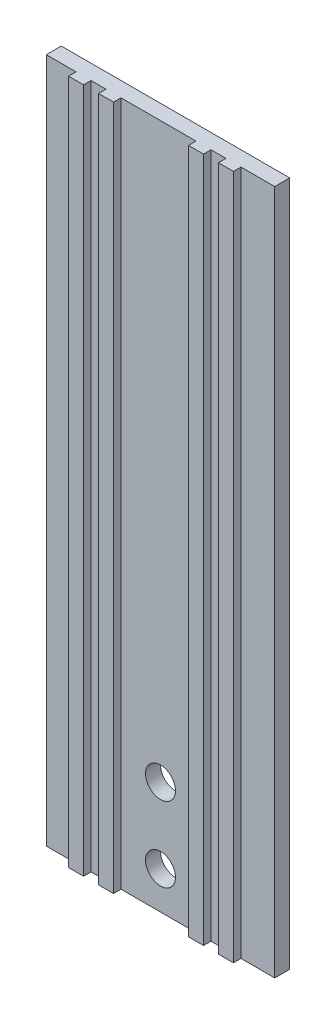
ISO-10303-21;
HEADER;
FILE_DESCRIPTION(('STEP AP214'),'2;1');
FILE_NAME('part.step','',(''),(''),'','','');
FILE_SCHEMA(('AUTOMOTIVE_DESIGN { 1 0 10303 214 1 1 1 1 }'));
ENDSEC;
DATA;
#1=APPLICATION_CONTEXT('core data for automotive mechanical design processes');
#2=APPLICATION_PROTOCOL_DEFINITION('international standard','automotive_design',2000,#1);
#3=PRODUCT_CONTEXT('',#1,'mechanical');
#4=PRODUCT('Part','Part','',(#3));
#5=PRODUCT_RELATED_PRODUCT_CATEGORY('part','',(#4));
#6=PRODUCT_DEFINITION_FORMATION('','',#4);
#7=PRODUCT_DEFINITION_CONTEXT('part definition',#1,'design');
#8=PRODUCT_DEFINITION('design','',#6,#7);
#9=PRODUCT_DEFINITION_SHAPE('','',#8);
#10=(LENGTH_UNIT() NAMED_UNIT(*) SI_UNIT(.MILLI.,.METRE.));
#11=(NAMED_UNIT(*) PLANE_ANGLE_UNIT() SI_UNIT($,.RADIAN.));
#12=(NAMED_UNIT(*) SI_UNIT($,.STERADIAN.) SOLID_ANGLE_UNIT());
#13=UNCERTAINTY_MEASURE_WITH_UNIT(LENGTH_MEASURE(1.E-05),#10,'distance_accuracy_value','');
#14=(GEOMETRIC_REPRESENTATION_CONTEXT(3) GLOBAL_UNCERTAINTY_ASSIGNED_CONTEXT((#13)) GLOBAL_UNIT_ASSIGNED_CONTEXT((#10,
#11,#12)) REPRESENTATION_CONTEXT('',''));
#15=CARTESIAN_POINT('',(0.,0.,0.));
#16=DIRECTION('',(0.,0.,1.));
#17=DIRECTION('',(1.,0.,0.));
#18=AXIS2_PLACEMENT_3D('',#15,#16,#17);
#19=CARTESIAN_POINT('',(0.,0.,10.));
#20=DIRECTION('',(0.,0.,1.));
#21=DIRECTION('',(1.,0.,0.));
#22=AXIS2_PLACEMENT_3D('',#19,#20,#21);
#23=PLANE('',#22);
#24=DIRECTION('',(1.,0.,0.));
#25=VECTOR('',#24,1.);
#26=CARTESIAN_POINT('',(0.,228.6,10.));
#27=LINE('',#26,#25);
#28=CARTESIAN_POINT('',(-46.3342334233424,228.6,10.));
#29=VERTEX_POINT('',#28);
#30=CARTESIAN_POINT('',(-36.3342334233425,228.6,10.));
#31=VERTEX_POINT('',#30);
#32=EDGE_CURVE('E312',#29,#31,#27,.T.);
#33=ORIENTED_EDGE('',*,*,#32,.F.);
#34=DIRECTION('',(0.,-1.,0.));
#35=VECTOR('',#34,1.);
#36=CARTESIAN_POINT('',(-46.3342334233424,228.6,10.));
#37=LINE('',#36,#35);
#38=CARTESIAN_POINT('',(-46.3342334233424,-228.6,10.));
#39=VERTEX_POINT('',#38);
#40=EDGE_CURVE('E247',#29,#39,#37,.T.);
#41=ORIENTED_EDGE('',*,*,#40,.T.);
#42=DIRECTION('',(-1.,0.,0.));
#43=VECTOR('',#42,1.);
#44=CARTESIAN_POINT('',(0.,-228.6,10.));
#45=LINE('',#44,#43);
#46=CARTESIAN_POINT('',(-36.3342334233424,-228.6,10.));
#47=VERTEX_POINT('',#46);
#48=EDGE_CURVE('E358',#47,#39,#45,.T.);
#49=ORIENTED_EDGE('',*,*,#48,.F.);
#50=DIRECTION('',(0.,-1.,0.));
#51=VECTOR('',#50,1.);
#52=CARTESIAN_POINT('',(-36.3342334233425,228.6,10.));
#53=LINE('',#52,#51);
#54=EDGE_CURVE('E234',#31,#47,#53,.T.);
#55=ORIENTED_EDGE('',*,*,#54,.F.);
#56=EDGE_LOOP('',(#33,#41,#49,#55));
#57=FACE_BOUND('',#56,.T.);
#58=ADVANCED_FACE('F43',(#57),#23,.T.);
#59=CARTESIAN_POINT('',(0.,-153.6,10.));
#60=DIRECTION('',(0.,0.,1.));
#61=DIRECTION('',(1.,0.,0.));
#62=AXIS2_PLACEMENT_3D('',#59,#60,#61);
#63=CIRCLE('',#62,10.);
#64=CARTESIAN_POINT('',(10.,-153.6,10.));
#65=VERTEX_POINT('',#64);
#66=EDGE_CURVE('E290',#65,#65,#63,.T.);
#67=ORIENTED_EDGE('',*,*,#66,.F.);
#68=EDGE_LOOP('',(#67));
#69=FACE_BOUND('',#68,.T.);
#70=CARTESIAN_POINT('',(0.,-203.6,10.));
#71=DIRECTION('',(0.,0.,1.));
#72=DIRECTION('',(1.,0.,0.));
#73=AXIS2_PLACEMENT_3D('',#70,#71,#72);
#74=CIRCLE('',#73,10.);
#75=CARTESIAN_POINT('',(10.,-203.6,10.));
#76=VERTEX_POINT('',#75);
#77=EDGE_CURVE('E293',#76,#76,#74,.T.);
#78=ORIENTED_EDGE('',*,*,#77,.F.);
#79=EDGE_LOOP('',(#78));
#80=FACE_BOUND('',#79,.T.);
#81=CARTESIAN_POINT('',(-26.3342334233425,228.6,10.));
#82=VERTEX_POINT('',#81);
#83=CARTESIAN_POINT('',(23.6657665766575,228.6,10.));
#84=VERTEX_POINT('',#83);
#85=EDGE_CURVE('E385',#82,#84,#27,.T.);
#86=ORIENTED_EDGE('',*,*,#85,.F.);
#87=DIRECTION('',(0.,-1.,0.));
#88=VECTOR('',#87,1.);
#89=CARTESIAN_POINT('',(-26.3342334233425,228.6,10.));
#90=LINE('',#89,#88);
#91=CARTESIAN_POINT('',(-26.3342334233424,-228.6,10.));
#92=VERTEX_POINT('',#91);
#93=EDGE_CURVE('E225',#82,#92,#90,.T.);
#94=ORIENTED_EDGE('',*,*,#93,.T.);
#95=CARTESIAN_POINT('',(23.6657665766576,-228.6,10.));
#96=VERTEX_POINT('',#95);
#97=EDGE_CURVE('E356',#96,#92,#45,.T.);
#98=ORIENTED_EDGE('',*,*,#97,.F.);
#99=DIRECTION('',(0.,-1.,0.));
#100=VECTOR('',#99,1.);
#101=CARTESIAN_POINT('',(23.6657665766575,228.6,10.));
#102=LINE('',#101,#100);
#103=EDGE_CURVE('E202',#84,#96,#102,.T.);
#104=ORIENTED_EDGE('',*,*,#103,.F.);
#105=EDGE_LOOP('',(#86,#94,#98,#104));
#106=FACE_BOUND('',#105,.T.);
#107=ADVANCED_FACE('F391',(#69,#80,#106),#23,.T.);
#108=CARTESIAN_POINT('',(53.6657665766575,228.6,10.));
#109=VERTEX_POINT('',#108);
#110=CARTESIAN_POINT('',(76.2,228.6,10.));
#111=VERTEX_POINT('',#110);
#112=EDGE_CURVE('E307',#109,#111,#27,.T.);
#113=ORIENTED_EDGE('',*,*,#112,.F.);
#114=DIRECTION('',(0.,-1.,0.));
#115=VECTOR('',#114,1.);
#116=CARTESIAN_POINT('',(53.6657665766575,228.6,10.));
#117=LINE('',#116,#115);
#118=CARTESIAN_POINT('',(53.6657665766576,-228.6,10.));
#119=VERTEX_POINT('',#118);
#120=EDGE_CURVE('E192',#109,#119,#117,.T.);
#121=ORIENTED_EDGE('',*,*,#120,.T.);
#122=CARTESIAN_POINT('',(76.2,-228.6,10.));
#123=VERTEX_POINT('',#122);
#124=EDGE_CURVE('E301',#123,#119,#45,.T.);
#125=ORIENTED_EDGE('',*,*,#124,.F.);
#126=DIRECTION('',(0.,-1.,0.));
#127=VECTOR('',#126,1.);
#128=CARTESIAN_POINT('',(76.2,0.,10.));
#129=LINE('',#128,#127);
#130=EDGE_CURVE('E303',#111,#123,#129,.T.);
#131=ORIENTED_EDGE('',*,*,#130,.F.);
#132=EDGE_LOOP('',(#113,#121,#125,#131));
#133=FACE_BOUND('',#132,.T.);
#134=ADVANCED_FACE('F346',(#133),#23,.T.);
#135=DIRECTION('',(0.,-1.,0.));
#136=VECTOR('',#135,1.);
#137=CARTESIAN_POINT('',(43.6657665766575,228.6,10.));
#138=LINE('',#137,#136);
#139=CARTESIAN_POINT('',(43.6657665766575,228.6,10.));
#140=VERTEX_POINT('',#139);
#141=CARTESIAN_POINT('',(43.6657665766576,-228.6,10.));
#142=VERTEX_POINT('',#141);
#143=EDGE_CURVE('E198',#140,#142,#138,.T.);
#144=ORIENTED_EDGE('',*,*,#143,.F.);
#145=CARTESIAN_POINT('',(33.6657665766575,228.6,10.));
#146=VERTEX_POINT('',#145);
#147=EDGE_CURVE('E352',#146,#140,#27,.T.);
#148=ORIENTED_EDGE('',*,*,#147,.F.);
#149=DIRECTION('',(0.,-1.,0.));
#150=VECTOR('',#149,1.);
#151=CARTESIAN_POINT('',(33.6657665766575,228.6,10.));
#152=LINE('',#151,#150);
#153=CARTESIAN_POINT('',(33.6657665766576,-228.6,10.));
#154=VERTEX_POINT('',#153);
#155=EDGE_CURVE('E268',#146,#154,#152,.T.);
#156=ORIENTED_EDGE('',*,*,#155,.T.);
#157=EDGE_CURVE('E304',#142,#154,#45,.T.);
#158=ORIENTED_EDGE('',*,*,#157,.F.);
#159=EDGE_LOOP('',(#144,#148,#156,#158));
#160=FACE_BOUND('',#159,.T.);
#161=ADVANCED_FACE('F354',(#160),#23,.T.);
#162=CARTESIAN_POINT('',(-76.2,0.,10.));
#163=DIRECTION('',(-1.,0.,0.));
#164=DIRECTION('',(0.,0.,1.));
#165=AXIS2_PLACEMENT_3D('',#162,#163,#164);
#166=PLANE('',#165);
#167=DIRECTION('',(0.,1.,0.));
#168=VECTOR('',#167,1.);
#169=CARTESIAN_POINT('',(-76.2,0.,0.));
#170=LINE('',#169,#168);
#171=CARTESIAN_POINT('',(-76.2,-228.6,0.));
#172=VERTEX_POINT('',#171);
#173=CARTESIAN_POINT('',(-76.2,228.6,0.));
#174=VERTEX_POINT('',#173);
#175=EDGE_CURVE('E318',#172,#174,#170,.T.);
#176=ORIENTED_EDGE('',*,*,#175,.F.);
#177=DIRECTION('',(0.,0.,-1.));
#178=VECTOR('',#177,1.);
#179=CARTESIAN_POINT('',(-76.2,-228.6,10.));
#180=LINE('',#179,#178);
#181=CARTESIAN_POINT('',(-76.2,-228.6,10.));
#182=VERTEX_POINT('',#181);
#183=EDGE_CURVE('E11',#182,#172,#180,.T.);
#184=ORIENTED_EDGE('',*,*,#183,.F.);
#185=DIRECTION('',(0.,1.,0.));
#186=VECTOR('',#185,1.);
#187=CARTESIAN_POINT('',(-76.2,0.,10.));
#188=LINE('',#187,#186);
#189=CARTESIAN_POINT('',(-76.2,228.6,10.));
#190=VERTEX_POINT('',#189);
#191=EDGE_CURVE('E297',#182,#190,#188,.T.);
#192=ORIENTED_EDGE('',*,*,#191,.T.);
#193=DIRECTION('',(0.,0.,-1.));
#194=VECTOR('',#193,1.);
#195=CARTESIAN_POINT('',(-76.2,228.6,10.));
#196=LINE('',#195,#194);
#197=EDGE_CURVE('E311',#190,#174,#196,.T.);
#198=ORIENTED_EDGE('',*,*,#197,.T.);
#199=EDGE_LOOP('',(#176,#184,#192,#198));
#200=FACE_BOUND('',#199,.T.);
#201=ADVANCED_FACE('F368',(#200),#166,.T.);
#202=CARTESIAN_POINT('',(0.,-228.6,10.));
#203=DIRECTION('',(0.,-1.,0.));
#204=DIRECTION('',(0.,0.,-1.));
#205=AXIS2_PLACEMENT_3D('',#202,#203,#204);
#206=PLANE('',#205);
#207=DIRECTION('',(-1.,0.,0.));
#208=VECTOR('',#207,1.);
#209=CARTESIAN_POINT('',(0.,-228.6,0.));
#210=LINE('',#209,#208);
#211=CARTESIAN_POINT('',(76.2,-228.6,0.));
#212=VERTEX_POINT('',#211);
#213=EDGE_CURVE('E321',#212,#172,#210,.T.);
#214=ORIENTED_EDGE('',*,*,#213,.F.);
#215=DIRECTION('',(0.,0.,-1.));
#216=VECTOR('',#215,1.);
#217=CARTESIAN_POINT('',(76.2,-228.6,10.));
#218=LINE('',#217,#216);
#219=EDGE_CURVE('E51',#123,#212,#218,.T.);
#220=ORIENTED_EDGE('',*,*,#219,.F.);
#221=ORIENTED_EDGE('',*,*,#124,.T.);
#222=DIRECTION('',(0.,0.,-1.));
#223=VECTOR('',#222,1.);
#224=CARTESIAN_POINT('',(53.6657665766576,-228.6,15.));
#225=LINE('',#224,#223);
#226=CARTESIAN_POINT('',(53.6657665766576,-228.6,15.));
#227=VERTEX_POINT('',#226);
#228=EDGE_CURVE('E203',#227,#119,#225,.T.);
#229=ORIENTED_EDGE('',*,*,#228,.F.);
#230=DIRECTION('',(-1.,0.,0.));
#231=VECTOR('',#230,1.);
#232=CARTESIAN_POINT('',(53.6657665766576,-228.6,15.));
#233=LINE('',#232,#231);
#234=CARTESIAN_POINT('',(43.6657665766576,-228.6,15.));
#235=VERTEX_POINT('',#234);
#236=EDGE_CURVE('E187',#227,#235,#233,.T.);
#237=ORIENTED_EDGE('',*,*,#236,.T.);
#238=DIRECTION('',(0.,0.,-1.));
#239=VECTOR('',#238,1.);
#240=CARTESIAN_POINT('',(43.6657665766576,-228.6,15.));
#241=LINE('',#240,#239);
#242=EDGE_CURVE('E195',#235,#142,#241,.T.);
#243=ORIENTED_EDGE('',*,*,#242,.T.);
#244=ORIENTED_EDGE('',*,*,#157,.T.);
#245=DIRECTION('',(0.,0.,-1.));
#246=VECTOR('',#245,1.);
#247=CARTESIAN_POINT('',(33.6657665766576,-228.6,15.));
#248=LINE('',#247,#246);
#249=CARTESIAN_POINT('',(33.6657665766576,-228.6,15.));
#250=VERTEX_POINT('',#249);
#251=EDGE_CURVE('E285',#250,#154,#248,.T.);
#252=ORIENTED_EDGE('',*,*,#251,.F.);
#253=DIRECTION('',(-1.,0.,0.));
#254=VECTOR('',#253,1.);
#255=CARTESIAN_POINT('',(33.6657665766576,-228.6,15.));
#256=LINE('',#255,#254);
#257=CARTESIAN_POINT('',(23.6657665766576,-228.6,15.));
#258=VERTEX_POINT('',#257);
#259=EDGE_CURVE('E267',#250,#258,#256,.T.);
#260=ORIENTED_EDGE('',*,*,#259,.T.);
#261=DIRECTION('',(0.,0.,-1.));
#262=VECTOR('',#261,1.);
#263=CARTESIAN_POINT('',(23.6657665766576,-228.6,15.));
#264=LINE('',#263,#262);
#265=EDGE_CURVE('E287',#258,#96,#264,.T.);
#266=ORIENTED_EDGE('',*,*,#265,.T.);
#267=ORIENTED_EDGE('',*,*,#97,.T.);
#268=DIRECTION('',(0.,0.,-1.));
#269=VECTOR('',#268,1.);
#270=CARTESIAN_POINT('',(-26.3342334233424,-228.6,15.));
#271=LINE('',#270,#269);
#272=CARTESIAN_POINT('',(-26.3342334233424,-228.6,15.));
#273=VERTEX_POINT('',#272);
#274=EDGE_CURVE('E66',#273,#92,#271,.T.);
#275=ORIENTED_EDGE('',*,*,#274,.F.);
#276=DIRECTION('',(-1.,0.,0.));
#277=VECTOR('',#276,1.);
#278=CARTESIAN_POINT('',(-26.3342334233424,-228.6,15.));
#279=LINE('',#278,#277);
#280=CARTESIAN_POINT('',(-36.3342334233424,-228.6,15.));
#281=VERTEX_POINT('',#280);
#282=EDGE_CURVE('E224',#273,#281,#279,.T.);
#283=ORIENTED_EDGE('',*,*,#282,.T.);
#284=DIRECTION('',(0.,0.,-1.));
#285=VECTOR('',#284,1.);
#286=CARTESIAN_POINT('',(-36.3342334233424,-228.6,15.));
#287=LINE('',#286,#285);
#288=EDGE_CURVE('E215',#281,#47,#287,.T.);
#289=ORIENTED_EDGE('',*,*,#288,.T.);
#290=ORIENTED_EDGE('',*,*,#48,.T.);
#291=DIRECTION('',(0.,0.,-1.));
#292=VECTOR('',#291,1.);
#293=CARTESIAN_POINT('',(-46.3342334233424,-228.6,15.));
#294=LINE('',#293,#292);
#295=CARTESIAN_POINT('',(-46.3342334233424,-228.6,15.));
#296=VERTEX_POINT('',#295);
#297=EDGE_CURVE('E58',#296,#39,#294,.T.);
#298=ORIENTED_EDGE('',*,*,#297,.F.);
#299=DIRECTION('',(-1.,0.,0.));
#300=VECTOR('',#299,1.);
#301=CARTESIAN_POINT('',(-46.3342334233424,-228.6,15.));
#302=LINE('',#301,#300);
#303=CARTESIAN_POINT('',(-56.3342334233424,-228.6,15.));
#304=VERTEX_POINT('',#303);
#305=EDGE_CURVE('E246',#296,#304,#302,.T.);
#306=ORIENTED_EDGE('',*,*,#305,.T.);
#307=DIRECTION('',(0.,0.,-1.));
#308=VECTOR('',#307,1.);
#309=CARTESIAN_POINT('',(-56.3342334233424,-228.6,15.));
#310=LINE('',#309,#308);
#311=CARTESIAN_POINT('',(-56.3342334233424,-228.6,10.));
#312=VERTEX_POINT('',#311);
#313=EDGE_CURVE('E237',#304,#312,#310,.T.);
#314=ORIENTED_EDGE('',*,*,#313,.T.);
#315=EDGE_CURVE('E300',#312,#182,#45,.T.);
#316=ORIENTED_EDGE('',*,*,#315,.T.);
#317=ORIENTED_EDGE('',*,*,#183,.T.);
#318=EDGE_LOOP('',(#214,#220,#221,#229,#237,#243,#244,#252,#260,#266,#267,#275,#283,#289,#290,
#298,#306,#314,#316,#317));
#319=FACE_BOUND('',#318,.T.);
#320=ADVANCED_FACE('F206',(#319),#206,.T.);
#321=CARTESIAN_POINT('',(76.2,0.,10.));
#322=DIRECTION('',(1.,0.,0.));
#323=DIRECTION('',(0.,0.,-1.));
#324=AXIS2_PLACEMENT_3D('',#321,#322,#323);
#325=PLANE('',#324);
#326=DIRECTION('',(0.,-1.,0.));
#327=VECTOR('',#326,1.);
#328=CARTESIAN_POINT('',(76.2,0.,0.));
#329=LINE('',#328,#327);
#330=CARTESIAN_POINT('',(76.2,228.6,0.));
#331=VERTEX_POINT('',#330);
#332=EDGE_CURVE('E324',#331,#212,#329,.T.);
#333=ORIENTED_EDGE('',*,*,#332,.F.);
#334=DIRECTION('',(0.,0.,-1.));
#335=VECTOR('',#334,1.);
#336=CARTESIAN_POINT('',(76.2,228.6,10.));
#337=LINE('',#336,#335);
#338=EDGE_CURVE('E330',#111,#331,#337,.T.);
#339=ORIENTED_EDGE('',*,*,#338,.F.);
#340=ORIENTED_EDGE('',*,*,#130,.T.);
#341=ORIENTED_EDGE('',*,*,#219,.T.);
#342=EDGE_LOOP('',(#333,#339,#340,#341));
#343=FACE_BOUND('',#342,.T.);
#344=ADVANCED_FACE('F333',(#343),#325,.T.);
#345=CARTESIAN_POINT('',(0.,-203.6,10.));
#346=DIRECTION('',(0.,0.,-1.));
#347=DIRECTION('',(-1.,0.,0.));
#348=AXIS2_PLACEMENT_3D('',#345,#346,#347);
#349=CYLINDRICAL_SURFACE('',#348,10.);
#350=ORIENTED_EDGE('',*,*,#77,.T.);
#351=EDGE_LOOP('',(#350));
#352=FACE_BOUND('',#351,.T.);
#353=CARTESIAN_POINT('',(0.,-203.6,0.));
#354=DIRECTION('',(0.,0.,1.));
#355=DIRECTION('',(1.,0.,0.));
#356=AXIS2_PLACEMENT_3D('',#353,#354,#355);
#357=CIRCLE('',#356,10.);
#358=CARTESIAN_POINT('',(10.,-203.6,0.));
#359=VERTEX_POINT('',#358);
#360=EDGE_CURVE('E315',#359,#359,#357,.T.);
#361=ORIENTED_EDGE('',*,*,#360,.F.);
#362=EDGE_LOOP('',(#361));
#363=FACE_BOUND('',#362,.T.);
#364=ADVANCED_FACE('F622',(#352,#363),#349,.F.);
#365=CARTESIAN_POINT('',(0.,-153.6,10.));
#366=DIRECTION('',(0.,0.,-1.));
#367=DIRECTION('',(-1.,0.,0.));
#368=AXIS2_PLACEMENT_3D('',#365,#366,#367);
#369=CYLINDRICAL_SURFACE('',#368,10.);
#370=ORIENTED_EDGE('',*,*,#66,.T.);
#371=EDGE_LOOP('',(#370));
#372=FACE_BOUND('',#371,.T.);
#373=CARTESIAN_POINT('',(0.,-153.6,0.));
#374=DIRECTION('',(0.,0.,1.));
#375=DIRECTION('',(1.,0.,0.));
#376=AXIS2_PLACEMENT_3D('',#373,#374,#375);
#377=CIRCLE('',#376,10.);
#378=CARTESIAN_POINT('',(10.,-153.6,0.));
#379=VERTEX_POINT('',#378);
#380=EDGE_CURVE('E289',#379,#379,#377,.T.);
#381=ORIENTED_EDGE('',*,*,#380,.F.);
#382=EDGE_LOOP('',(#381));
#383=FACE_BOUND('',#382,.T.);
#384=ADVANCED_FACE('F45',(#372,#383),#369,.F.);
#385=CARTESIAN_POINT('',(0.,228.6,10.));
#386=DIRECTION('',(0.,1.,0.));
#387=DIRECTION('',(-1.,0.,0.));
#388=AXIS2_PLACEMENT_3D('',#385,#386,#387);
#389=PLANE('',#388);
#390=DIRECTION('',(1.,0.,0.));
#391=VECTOR('',#390,1.);
#392=CARTESIAN_POINT('',(0.,228.6,0.));
#393=LINE('',#392,#391);
#394=EDGE_CURVE('E294',#174,#331,#393,.T.);
#395=ORIENTED_EDGE('',*,*,#394,.F.);
#396=ORIENTED_EDGE('',*,*,#197,.F.);
#397=CARTESIAN_POINT('',(-56.3342334233424,228.6,10.));
#398=VERTEX_POINT('',#397);
#399=EDGE_CURVE('E308',#190,#398,#27,.T.);
#400=ORIENTED_EDGE('',*,*,#399,.T.);
#401=DIRECTION('',(0.,0.,-1.));
#402=VECTOR('',#401,1.);
#403=CARTESIAN_POINT('',(-56.3342334233424,228.6,15.));
#404=LINE('',#403,#402);
#405=CARTESIAN_POINT('',(-56.3342334233424,228.6,15.));
#406=VERTEX_POINT('',#405);
#407=EDGE_CURVE('E255',#406,#398,#404,.T.);
#408=ORIENTED_EDGE('',*,*,#407,.F.);
#409=DIRECTION('',(1.,0.,0.));
#410=VECTOR('',#409,1.);
#411=CARTESIAN_POINT('',(-56.3342334233424,228.6,15.));
#412=LINE('',#411,#410);
#413=CARTESIAN_POINT('',(-46.3342334233424,228.6,15.));
#414=VERTEX_POINT('',#413);
#415=EDGE_CURVE('E252',#406,#414,#412,.T.);
#416=ORIENTED_EDGE('',*,*,#415,.T.);
#417=DIRECTION('',(0.,0.,-1.));
#418=VECTOR('',#417,1.);
#419=CARTESIAN_POINT('',(-46.3342334233424,228.6,15.));
#420=LINE('',#419,#418);
#421=EDGE_CURVE('E261',#414,#29,#420,.T.);
#422=ORIENTED_EDGE('',*,*,#421,.T.);
#423=ORIENTED_EDGE('',*,*,#32,.T.);
#424=DIRECTION('',(0.,0.,-1.));
#425=VECTOR('',#424,1.);
#426=CARTESIAN_POINT('',(-36.3342334233425,228.6,15.));
#427=LINE('',#426,#425);
#428=CARTESIAN_POINT('',(-36.3342334233425,228.6,15.));
#429=VERTEX_POINT('',#428);
#430=EDGE_CURVE('E233',#429,#31,#427,.T.);
#431=ORIENTED_EDGE('',*,*,#430,.F.);
#432=DIRECTION('',(1.,0.,0.));
#433=VECTOR('',#432,1.);
#434=CARTESIAN_POINT('',(-36.3342334233425,228.6,15.));
#435=LINE('',#434,#433);
#436=CARTESIAN_POINT('',(-26.3342334233425,228.6,15.));
#437=VERTEX_POINT('',#436);
#438=EDGE_CURVE('E230',#429,#437,#435,.T.);
#439=ORIENTED_EDGE('',*,*,#438,.T.);
#440=DIRECTION('',(0.,0.,-1.));
#441=VECTOR('',#440,1.);
#442=CARTESIAN_POINT('',(-26.3342334233425,228.6,15.));
#443=LINE('',#442,#441);
#444=EDGE_CURVE('E240',#437,#82,#443,.T.);
#445=ORIENTED_EDGE('',*,*,#444,.T.);
#446=ORIENTED_EDGE('',*,*,#85,.T.);
#447=DIRECTION('',(0.,0.,-1.));
#448=VECTOR('',#447,1.);
#449=CARTESIAN_POINT('',(23.6657665766575,228.6,15.));
#450=LINE('',#449,#448);
#451=CARTESIAN_POINT('',(23.6657665766575,228.6,15.));
#452=VERTEX_POINT('',#451);
#453=EDGE_CURVE('E277',#452,#84,#450,.T.);
#454=ORIENTED_EDGE('',*,*,#453,.F.);
#455=DIRECTION('',(1.,0.,0.));
#456=VECTOR('',#455,1.);
#457=CARTESIAN_POINT('',(23.6657665766575,228.6,15.));
#458=LINE('',#457,#456);
#459=CARTESIAN_POINT('',(33.6657665766575,228.6,15.));
#460=VERTEX_POINT('',#459);
#461=EDGE_CURVE('E274',#452,#460,#458,.T.);
#462=ORIENTED_EDGE('',*,*,#461,.T.);
#463=DIRECTION('',(0.,0.,-1.));
#464=VECTOR('',#463,1.);
#465=CARTESIAN_POINT('',(33.6657665766575,228.6,15.));
#466=LINE('',#465,#464);
#467=EDGE_CURVE('E283',#460,#146,#466,.T.);
#468=ORIENTED_EDGE('',*,*,#467,.T.);
#469=ORIENTED_EDGE('',*,*,#147,.T.);
#470=DIRECTION('',(0.,0.,-1.));
#471=VECTOR('',#470,1.);
#472=CARTESIAN_POINT('',(43.6657665766575,228.6,15.));
#473=LINE('',#472,#471);
#474=CARTESIAN_POINT('',(43.6657665766575,228.6,15.));
#475=VERTEX_POINT('',#474);
#476=EDGE_CURVE('E213',#475,#140,#473,.T.);
#477=ORIENTED_EDGE('',*,*,#476,.F.);
#478=DIRECTION('',(1.,0.,0.));
#479=VECTOR('',#478,1.);
#480=CARTESIAN_POINT('',(43.6657665766575,228.6,15.));
#481=LINE('',#480,#479);
#482=CARTESIAN_POINT('',(53.6657665766575,228.6,15.));
#483=VERTEX_POINT('',#482);
#484=EDGE_CURVE('E190',#475,#483,#481,.T.);
#485=ORIENTED_EDGE('',*,*,#484,.T.);
#486=DIRECTION('',(0.,0.,-1.));
#487=VECTOR('',#486,1.);
#488=CARTESIAN_POINT('',(53.6657665766575,228.6,15.));
#489=LINE('',#488,#487);
#490=EDGE_CURVE('E219',#483,#109,#489,.T.);
#491=ORIENTED_EDGE('',*,*,#490,.T.);
#492=ORIENTED_EDGE('',*,*,#112,.T.);
#493=ORIENTED_EDGE('',*,*,#338,.T.);
#494=EDGE_LOOP('',(#395,#396,#400,#408,#416,#422,#423,#431,#439,#445,#446,#454,#462,#468,#469,
#477,#485,#491,#492,#493));
#495=FACE_BOUND('',#494,.T.);
#496=ADVANCED_FACE('F343',(#495),#389,.T.);
#497=DIRECTION('',(0.,-1.,0.));
#498=VECTOR('',#497,1.);
#499=CARTESIAN_POINT('',(-56.3342334233424,228.6,10.));
#500=LINE('',#499,#498);
#501=EDGE_CURVE('E256',#398,#312,#500,.T.);
#502=ORIENTED_EDGE('',*,*,#501,.F.);
#503=ORIENTED_EDGE('',*,*,#399,.F.);
#504=ORIENTED_EDGE('',*,*,#191,.F.);
#505=ORIENTED_EDGE('',*,*,#315,.F.);
#506=EDGE_LOOP('',(#502,#503,#504,#505));
#507=FACE_BOUND('',#506,.T.);
#508=ADVANCED_FACE('F370',(#507),#23,.T.);
#509=CARTESIAN_POINT('',(0.,0.,0.));
#510=DIRECTION('',(0.,0.,1.));
#511=DIRECTION('',(1.,0.,0.));
#512=AXIS2_PLACEMENT_3D('',#509,#510,#511);
#513=PLANE('',#512);
#514=ORIENTED_EDGE('',*,*,#380,.T.);
#515=EDGE_LOOP('',(#514));
#516=FACE_BOUND('',#515,.T.);
#517=ORIENTED_EDGE('',*,*,#360,.T.);
#518=EDGE_LOOP('',(#517));
#519=FACE_BOUND('',#518,.T.);
#520=ORIENTED_EDGE('',*,*,#175,.T.);
#521=ORIENTED_EDGE('',*,*,#394,.T.);
#522=ORIENTED_EDGE('',*,*,#332,.T.);
#523=ORIENTED_EDGE('',*,*,#213,.T.);
#524=EDGE_LOOP('',(#520,#521,#522,#523));
#525=FACE_BOUND('',#524,.T.);
#526=ADVANCED_FACE('F340',(#516,#519,#525),#513,.F.);
#527=CARTESIAN_POINT('',(23.6657665766575,228.6,15.));
#528=DIRECTION('',(1.,0.,0.));
#529=DIRECTION('',(0.,1.,0.));
#530=AXIS2_PLACEMENT_3D('',#527,#528,#529);
#531=PLANE('',#530);
#532=ORIENTED_EDGE('',*,*,#103,.T.);
#533=ORIENTED_EDGE('',*,*,#265,.F.);
#534=DIRECTION('',(0.,-1.,0.));
#535=VECTOR('',#534,1.);
#536=CARTESIAN_POINT('',(23.6657665766575,228.6,15.));
#537=LINE('',#536,#535);
#538=EDGE_CURVE('E265',#452,#258,#537,.T.);
#539=ORIENTED_EDGE('',*,*,#538,.F.);
#540=ORIENTED_EDGE('',*,*,#453,.T.);
#541=EDGE_LOOP('',(#532,#533,#539,#540));
#542=FACE_BOUND('',#541,.T.);
#543=ADVANCED_FACE('F394',(#542),#531,.F.);
#544=CARTESIAN_POINT('',(33.6657665766575,228.6,15.));
#545=DIRECTION('',(1.,0.,0.));
#546=DIRECTION('',(0.,1.,0.));
#547=AXIS2_PLACEMENT_3D('',#544,#545,#546);
#548=PLANE('',#547);
#549=ORIENTED_EDGE('',*,*,#155,.F.);
#550=ORIENTED_EDGE('',*,*,#467,.F.);
#551=DIRECTION('',(0.,-1.,0.));
#552=VECTOR('',#551,1.);
#553=CARTESIAN_POINT('',(33.6657665766575,228.6,15.));
#554=LINE('',#553,#552);
#555=EDGE_CURVE('E271',#460,#250,#554,.T.);
#556=ORIENTED_EDGE('',*,*,#555,.T.);
#557=ORIENTED_EDGE('',*,*,#251,.T.);
#558=EDGE_LOOP('',(#549,#550,#556,#557));
#559=FACE_BOUND('',#558,.T.);
#560=ADVANCED_FACE('F401',(#559),#548,.T.);
#561=CARTESIAN_POINT('',(0.,0.,15.));
#562=DIRECTION('',(0.,0.,-1.));
#563=DIRECTION('',(-1.,0.,0.));
#564=AXIS2_PLACEMENT_3D('',#561,#562,#563);
#565=PLANE('',#564);
#566=ORIENTED_EDGE('',*,*,#538,.T.);
#567=ORIENTED_EDGE('',*,*,#259,.F.);
#568=ORIENTED_EDGE('',*,*,#555,.F.);
#569=ORIENTED_EDGE('',*,*,#461,.F.);
#570=EDGE_LOOP('',(#566,#567,#568,#569));
#571=FACE_BOUND('',#570,.T.);
#572=ADVANCED_FACE('F399',(#571),#565,.F.);
#573=CARTESIAN_POINT('',(43.6657665766575,228.6,15.));
#574=DIRECTION('',(1.,0.,0.));
#575=DIRECTION('',(0.,1.,0.));
#576=AXIS2_PLACEMENT_3D('',#573,#574,#575);
#577=PLANE('',#576);
#578=ORIENTED_EDGE('',*,*,#143,.T.);
#579=ORIENTED_EDGE('',*,*,#242,.F.);
#580=DIRECTION('',(0.,-1.,0.));
#581=VECTOR('',#580,1.);
#582=CARTESIAN_POINT('',(43.6657665766575,228.6,15.));
#583=LINE('',#582,#581);
#584=EDGE_CURVE('E182',#475,#235,#583,.T.);
#585=ORIENTED_EDGE('',*,*,#584,.F.);
#586=ORIENTED_EDGE('',*,*,#476,.T.);
#587=EDGE_LOOP('',(#578,#579,#585,#586));
#588=FACE_BOUND('',#587,.T.);
#589=ADVANCED_FACE('F196',(#588),#577,.F.);
#590=CARTESIAN_POINT('',(53.6657665766575,228.6,15.));
#591=DIRECTION('',(1.,0.,0.));
#592=DIRECTION('',(0.,1.,0.));
#593=AXIS2_PLACEMENT_3D('',#590,#591,#592);
#594=PLANE('',#593);
#595=ORIENTED_EDGE('',*,*,#120,.F.);
#596=ORIENTED_EDGE('',*,*,#490,.F.);
#597=DIRECTION('',(0.,-1.,0.));
#598=VECTOR('',#597,1.);
#599=CARTESIAN_POINT('',(53.6657665766575,228.6,15.));
#600=LINE('',#599,#598);
#601=EDGE_CURVE('E208',#483,#227,#600,.T.);
#602=ORIENTED_EDGE('',*,*,#601,.T.);
#603=ORIENTED_EDGE('',*,*,#228,.T.);
#604=EDGE_LOOP('',(#595,#596,#602,#603));
#605=FACE_BOUND('',#604,.T.);
#606=ADVANCED_FACE('F349',(#605),#594,.T.);
#607=CARTESIAN_POINT('',(0.,0.,15.));
#608=DIRECTION('',(0.,0.,-1.));
#609=DIRECTION('',(-1.,0.,0.));
#610=AXIS2_PLACEMENT_3D('',#607,#608,#609);
#611=PLANE('',#610);
#612=ORIENTED_EDGE('',*,*,#584,.T.);
#613=ORIENTED_EDGE('',*,*,#236,.F.);
#614=ORIENTED_EDGE('',*,*,#601,.F.);
#615=ORIENTED_EDGE('',*,*,#484,.F.);
#616=EDGE_LOOP('',(#612,#613,#614,#615));
#617=FACE_BOUND('',#616,.T.);
#618=ADVANCED_FACE('F184',(#617),#611,.F.);
#619=CARTESIAN_POINT('',(-36.3342334233425,228.6,15.));
#620=DIRECTION('',(1.,0.,0.));
#621=DIRECTION('',(0.,1.,0.));
#622=AXIS2_PLACEMENT_3D('',#619,#620,#621);
#623=PLANE('',#622);
#624=ORIENTED_EDGE('',*,*,#54,.T.);
#625=ORIENTED_EDGE('',*,*,#288,.F.);
#626=DIRECTION('',(0.,-1.,0.));
#627=VECTOR('',#626,1.);
#628=CARTESIAN_POINT('',(-36.3342334233425,228.6,15.));
#629=LINE('',#628,#627);
#630=EDGE_CURVE('E222',#429,#281,#629,.T.);
#631=ORIENTED_EDGE('',*,*,#630,.F.);
#632=ORIENTED_EDGE('',*,*,#430,.T.);
#633=EDGE_LOOP('',(#624,#625,#631,#632));
#634=FACE_BOUND('',#633,.T.);
#635=ADVANCED_FACE('F488',(#634),#623,.F.);
#636=CARTESIAN_POINT('',(-26.3342334233425,228.6,15.));
#637=DIRECTION('',(1.,0.,0.));
#638=DIRECTION('',(0.,1.,0.));
#639=AXIS2_PLACEMENT_3D('',#636,#637,#638);
#640=PLANE('',#639);
#641=ORIENTED_EDGE('',*,*,#93,.F.);
#642=ORIENTED_EDGE('',*,*,#444,.F.);
#643=DIRECTION('',(0.,-1.,0.));
#644=VECTOR('',#643,1.);
#645=CARTESIAN_POINT('',(-26.3342334233425,228.6,15.));
#646=LINE('',#645,#644);
#647=EDGE_CURVE('E228',#437,#273,#646,.T.);
#648=ORIENTED_EDGE('',*,*,#647,.T.);
#649=ORIENTED_EDGE('',*,*,#274,.T.);
#650=EDGE_LOOP('',(#641,#642,#648,#649));
#651=FACE_BOUND('',#650,.T.);
#652=ADVANCED_FACE('F496',(#651),#640,.T.);
#653=CARTESIAN_POINT('',(0.,0.,15.));
#654=DIRECTION('',(0.,0.,-1.));
#655=DIRECTION('',(-1.,0.,0.));
#656=AXIS2_PLACEMENT_3D('',#653,#654,#655);
#657=PLANE('',#656);
#658=ORIENTED_EDGE('',*,*,#630,.T.);
#659=ORIENTED_EDGE('',*,*,#282,.F.);
#660=ORIENTED_EDGE('',*,*,#647,.F.);
#661=ORIENTED_EDGE('',*,*,#438,.F.);
#662=EDGE_LOOP('',(#658,#659,#660,#661));
#663=FACE_BOUND('',#662,.T.);
#664=ADVANCED_FACE('F505',(#663),#657,.F.);
#665=CARTESIAN_POINT('',(-56.3342334233424,228.6,15.));
#666=DIRECTION('',(1.,0.,0.));
#667=DIRECTION('',(0.,1.,0.));
#668=AXIS2_PLACEMENT_3D('',#665,#666,#667);
#669=PLANE('',#668);
#670=ORIENTED_EDGE('',*,*,#501,.T.);
#671=ORIENTED_EDGE('',*,*,#313,.F.);
#672=DIRECTION('',(0.,-1.,0.));
#673=VECTOR('',#672,1.);
#674=CARTESIAN_POINT('',(-56.3342334233424,228.6,15.));
#675=LINE('',#674,#673);
#676=EDGE_CURVE('E244',#406,#304,#675,.T.);
#677=ORIENTED_EDGE('',*,*,#676,.F.);
#678=ORIENTED_EDGE('',*,*,#407,.T.);
#679=EDGE_LOOP('',(#670,#671,#677,#678));
#680=FACE_BOUND('',#679,.T.);
#681=ADVANCED_FACE('F374',(#680),#669,.F.);
#682=CARTESIAN_POINT('',(-46.3342334233424,228.6,15.));
#683=DIRECTION('',(1.,0.,0.));
#684=DIRECTION('',(0.,1.,0.));
#685=AXIS2_PLACEMENT_3D('',#682,#683,#684);
#686=PLANE('',#685);
#687=ORIENTED_EDGE('',*,*,#40,.F.);
#688=ORIENTED_EDGE('',*,*,#421,.F.);
#689=DIRECTION('',(0.,-1.,0.));
#690=VECTOR('',#689,1.);
#691=CARTESIAN_POINT('',(-46.3342334233424,228.6,15.));
#692=LINE('',#691,#690);
#693=EDGE_CURVE('E250',#414,#296,#692,.T.);
#694=ORIENTED_EDGE('',*,*,#693,.T.);
#695=ORIENTED_EDGE('',*,*,#297,.T.);
#696=EDGE_LOOP('',(#687,#688,#694,#695));
#697=FACE_BOUND('',#696,.T.);
#698=ADVANCED_FACE('F379',(#697),#686,.T.);
#699=CARTESIAN_POINT('',(0.,0.,15.));
#700=DIRECTION('',(0.,0.,-1.));
#701=DIRECTION('',(-1.,0.,0.));
#702=AXIS2_PLACEMENT_3D('',#699,#700,#701);
#703=PLANE('',#702);
#704=ORIENTED_EDGE('',*,*,#676,.T.);
#705=ORIENTED_EDGE('',*,*,#305,.F.);
#706=ORIENTED_EDGE('',*,*,#693,.F.);
#707=ORIENTED_EDGE('',*,*,#415,.F.);
#708=EDGE_LOOP('',(#704,#705,#706,#707));
#709=FACE_BOUND('',#708,.T.);
#710=ADVANCED_FACE('F378',(#709),#703,.F.);
#711=CLOSED_SHELL('',(#58,#107,#134,#161,#201,#320,#344,#364,#384,#496,#508,#526,#543,#560,#572,
#589,#606,#618,#635,#652,#664,#681,#698,#710));
#712=MANIFOLD_SOLID_BREP('B2',#711);
#713=ADVANCED_BREP_SHAPE_REPRESENTATION('',(#18,#712),#14);
#714=SHAPE_DEFINITION_REPRESENTATION(#9,#713);
ENDSEC;
END-ISO-10303-21;
